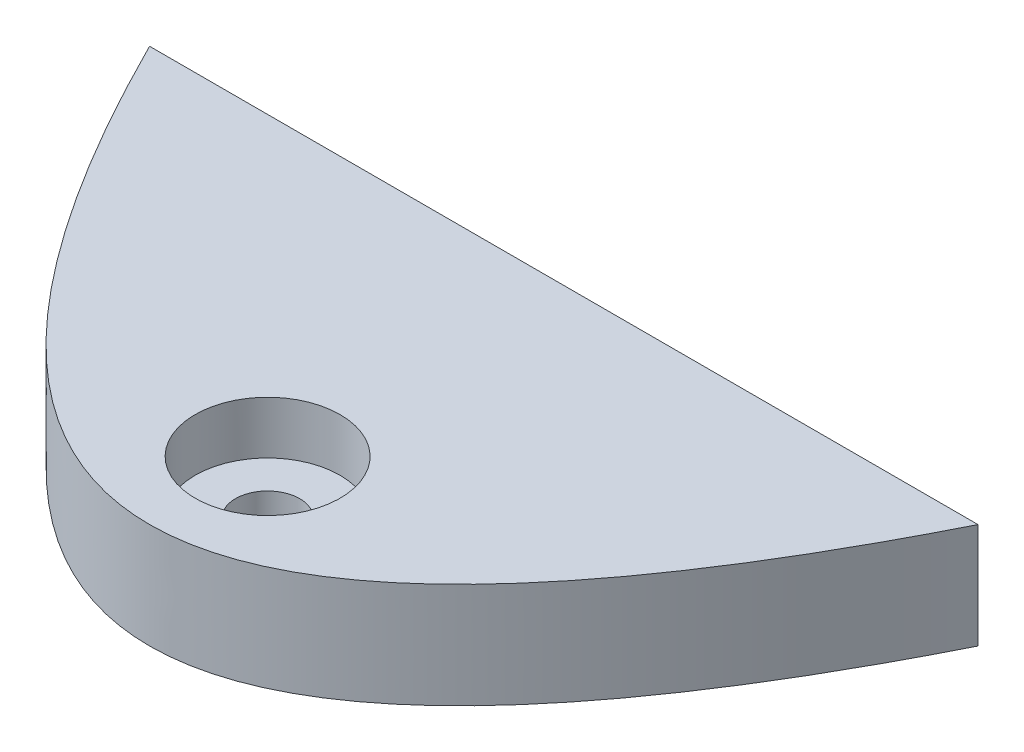
ISO-10303-21;
HEADER;
FILE_DESCRIPTION(('STEP AP214'),'2;1');
FILE_NAME('part.step','',(''),(''),'','','');
FILE_SCHEMA(('AUTOMOTIVE_DESIGN { 1 0 10303 214 1 1 1 1 }'));
ENDSEC;
DATA;
#1=APPLICATION_CONTEXT('core data for automotive mechanical design processes');
#2=APPLICATION_PROTOCOL_DEFINITION('international standard','automotive_design',2000,#1);
#3=PRODUCT_CONTEXT('',#1,'mechanical');
#4=PRODUCT('Part','Part','',(#3));
#5=PRODUCT_RELATED_PRODUCT_CATEGORY('part','',(#4));
#6=PRODUCT_DEFINITION_FORMATION('','',#4);
#7=PRODUCT_DEFINITION_CONTEXT('part definition',#1,'design');
#8=PRODUCT_DEFINITION('design','',#6,#7);
#9=PRODUCT_DEFINITION_SHAPE('','',#8);
#10=(LENGTH_UNIT() NAMED_UNIT(*) SI_UNIT(.MILLI.,.METRE.));
#11=(NAMED_UNIT(*) PLANE_ANGLE_UNIT() SI_UNIT($,.RADIAN.));
#12=(NAMED_UNIT(*) SI_UNIT($,.STERADIAN.) SOLID_ANGLE_UNIT());
#13=UNCERTAINTY_MEASURE_WITH_UNIT(LENGTH_MEASURE(1.E-05),#10,'distance_accuracy_value','');
#14=(GEOMETRIC_REPRESENTATION_CONTEXT(3) GLOBAL_UNCERTAINTY_ASSIGNED_CONTEXT((#13)) GLOBAL_UNIT_ASSIGNED_CONTEXT((#10,
#11,#12)) REPRESENTATION_CONTEXT('',''));
#15=CARTESIAN_POINT('',(0.,0.,0.));
#16=DIRECTION('',(0.,0.,1.));
#17=DIRECTION('',(1.,0.,0.));
#18=AXIS2_PLACEMENT_3D('',#15,#16,#17);
#19=CARTESIAN_POINT('',(0.,173.,142.999999999465));
#20=DIRECTION('',(0.,-1.,0.));
#21=DIRECTION('',(0.,0.,-1.));
#22=AXIS2_PLACEMENT_3D('',#19,#20,#21);
#23=CYLINDRICAL_SURFACE('',#22,15.5);
#24=CARTESIAN_POINT('',(0.,147.6,142.999999999465));
#25=DIRECTION('',(0.,1.,0.));
#26=DIRECTION('',(0.,0.,1.));
#27=AXIS2_PLACEMENT_3D('',#24,#25,#26);
#28=CIRCLE('',#27,15.5);
#29=CARTESIAN_POINT('',(0.,147.6,158.499999999465));
#30=VERTEX_POINT('',#29);
#31=EDGE_CURVE('E85',#30,#30,#28,.T.);
#32=ORIENTED_EDGE('',*,*,#31,.F.);
#33=EDGE_LOOP('',(#32));
#34=FACE_BOUND('',#33,.T.);
#35=CARTESIAN_POINT('',(0.,173.,142.999999999465));
#36=DIRECTION('',(0.,1.,0.));
#37=DIRECTION('',(0.,0.,1.));
#38=AXIS2_PLACEMENT_3D('',#35,#36,#37);
#39=CIRCLE('',#38,15.5);
#40=CARTESIAN_POINT('',(0.,173.,158.499999999465));
#41=VERTEX_POINT('',#40);
#42=EDGE_CURVE('E72',#41,#41,#39,.T.);
#43=ORIENTED_EDGE('',*,*,#42,.T.);
#44=EDGE_LOOP('',(#43));
#45=FACE_BOUND('',#44,.T.);
#46=ADVANCED_FACE('F35',(#34,#45),#23,.F.);
#47=CARTESIAN_POINT('',(0.,473.,142.999999999465));
#48=DIRECTION('',(0.,-1.,0.));
#49=DIRECTION('',(0.,0.,-1.));
#50=AXIS2_PLACEMENT_3D('',#47,#48,#49);
#51=CYLINDRICAL_SURFACE('',#50,35.);
#52=CARTESIAN_POINT('',(0.,198.4,142.999999999465));
#53=DIRECTION('',(0.,-1.,0.));
#54=DIRECTION('',(0.,0.,-1.));
#55=AXIS2_PLACEMENT_3D('',#52,#53,#54);
#56=CIRCLE('',#55,35.);
#57=CARTESIAN_POINT('',(0.,198.4,107.999999999465));
#58=VERTEX_POINT('',#57);
#59=EDGE_CURVE('E62',#58,#58,#56,.T.);
#60=ORIENTED_EDGE('',*,*,#59,.F.);
#61=EDGE_LOOP('',(#60));
#62=FACE_BOUND('',#61,.T.);
#63=CARTESIAN_POINT('',(0.,173.,142.999999999465));
#64=DIRECTION('',(0.,1.,0.));
#65=DIRECTION('',(0.,0.,1.));
#66=AXIS2_PLACEMENT_3D('',#63,#64,#65);
#67=CIRCLE('',#66,35.);
#68=CARTESIAN_POINT('',(0.,173.,177.999999999465));
#69=VERTEX_POINT('',#68);
#70=EDGE_CURVE('E74',#69,#69,#67,.T.);
#71=ORIENTED_EDGE('',*,*,#70,.F.);
#72=EDGE_LOOP('',(#71));
#73=FACE_BOUND('',#72,.T.);
#74=ADVANCED_FACE('F105',(#62,#73),#51,.F.);
#75=CARTESIAN_POINT('',(0.,173.,142.999999999465));
#76=DIRECTION('',(0.,1.,0.));
#77=DIRECTION('',(0.,0.,1.));
#78=AXIS2_PLACEMENT_3D('',#75,#76,#77);
#79=PLANE('',#78);
#80=ORIENTED_EDGE('',*,*,#42,.F.);
#81=EDGE_LOOP('',(#80));
#82=FACE_BOUND('',#81,.T.);
#83=ORIENTED_EDGE('',*,*,#70,.T.);
#84=EDGE_LOOP('',(#83));
#85=FACE_BOUND('',#84,.T.);
#86=ADVANCED_FACE('F108',(#82,#85),#79,.T.);
#87=CARTESIAN_POINT('',(-200.000000000337,300.,-6.70196537155832E-10));
#88=CARTESIAN_POINT('',(-5.91540705308091E-11,300.,400.000000000552));
#89=CARTESIAN_POINT('',(200.000000000219,300.,-4.34305369445553E-10));
#90=B_SPLINE_CURVE_WITH_KNOTS('',2,(#87,#88,#89),.UNSPECIFIED.,.F.,.F.,(3,3),(0.056028396232078,
0.943971603767659),.UNSPECIFIED.);
#91=DIRECTION('',(0.,-1.,0.));
#92=VECTOR('',#91,1.);
#93=SURFACE_OF_LINEAR_EXTRUSION('',#90,#92);
#94=DIRECTION('',(0.,-1.,0.));
#95=VECTOR('',#94,1.);
#96=CARTESIAN_POINT('',(200.000000000156,300.,-5.35238059385865E-10));
#97=LINE('',#96,#95);
#98=CARTESIAN_POINT('',(200.000000000156,198.4,-5.35238059385865E-10));
#99=VERTEX_POINT('',#98);
#100=CARTESIAN_POINT('',(200.000000000156,147.6,0.));
#101=VERTEX_POINT('',#100);
#102=EDGE_CURVE('E11',#99,#101,#97,.T.);
#103=ORIENTED_EDGE('',*,*,#102,.F.);
#104=CARTESIAN_POINT('',(-200.000000000337,198.4,-6.70196537155832E-10));
#105=CARTESIAN_POINT('',(-5.91540705308091E-11,198.4,400.000000000552));
#106=CARTESIAN_POINT('',(200.000000000219,198.4,-4.34305369445553E-10));
#107=B_SPLINE_CURVE_WITH_KNOTS('',2,(#104,#105,#106),.UNSPECIFIED.,.F.,.F.,(3,3),
(0.056028396232078,0.943971603767659),.UNSPECIFIED.);
#108=CARTESIAN_POINT('',(-200.00000000027,198.4,0.));
#109=VERTEX_POINT('',#108);
#110=EDGE_CURVE('E50',#99,#109,#107,.F.);
#111=ORIENTED_EDGE('',*,*,#110,.T.);
#112=DIRECTION('',(0.,-1.,0.));
#113=VECTOR('',#112,1.);
#114=CARTESIAN_POINT('',(-200.00000000027,300.,-5.35238059385865E-10));
#115=LINE('',#114,#113);
#116=CARTESIAN_POINT('',(-200.00000000027,147.6,-5.35238059385865E-10));
#117=VERTEX_POINT('',#116);
#118=EDGE_CURVE('E44',#109,#117,#115,.T.);
#119=ORIENTED_EDGE('',*,*,#118,.T.);
#120=CARTESIAN_POINT('',(-200.000000000337,147.6,-6.70196537155832E-10));
#121=CARTESIAN_POINT('',(-5.91540705308091E-11,147.6,400.000000000552));
#122=CARTESIAN_POINT('',(200.000000000219,147.6,-4.34305369445553E-10));
#123=B_SPLINE_CURVE_WITH_KNOTS('',2,(#120,#121,#122),.UNSPECIFIED.,.F.,.F.,(3,3),
(0.056028396232078,0.943971603767659),.UNSPECIFIED.);
#124=EDGE_CURVE('E88',#117,#101,#123,.T.);
#125=ORIENTED_EDGE('',*,*,#124,.T.);
#126=EDGE_LOOP('',(#103,#111,#119,#125));
#127=FACE_BOUND('',#126,.T.);
#128=ADVANCED_FACE('F37',(#127),#93,.F.);
#129=CARTESIAN_POINT('',(-200.00000000027,300.,-5.35238059385865E-10));
#130=DIRECTION('',(0.,0.,1.));
#131=DIRECTION('',(1.,0.,0.));
#132=AXIS2_PLACEMENT_3D('',#129,#130,#131);
#133=PLANE('',#132);
#134=ORIENTED_EDGE('',*,*,#118,.F.);
#135=DIRECTION('',(-1.,0.,0.));
#136=VECTOR('',#135,1.);
#137=CARTESIAN_POINT('',(262.005201889277,198.4,0.));
#138=LINE('',#137,#136);
#139=EDGE_CURVE('E63',#99,#109,#138,.T.);
#140=ORIENTED_EDGE('',*,*,#139,.F.);
#141=ORIENTED_EDGE('',*,*,#102,.T.);
#142=DIRECTION('',(1.,0.,0.));
#143=VECTOR('',#142,1.);
#144=CARTESIAN_POINT('',(249.331461890909,147.6,0.));
#145=LINE('',#144,#143);
#146=EDGE_CURVE('E71',#117,#101,#145,.T.);
#147=ORIENTED_EDGE('',*,*,#146,.F.);
#148=EDGE_LOOP('',(#134,#140,#141,#147));
#149=FACE_BOUND('',#148,.T.);
#150=ADVANCED_FACE('F69',(#149),#133,.F.);
#151=CARTESIAN_POINT('',(249.331461890909,147.6,200.000000000059));
#152=DIRECTION('',(0.,1.,0.));
#153=DIRECTION('',(0.,0.,1.));
#154=AXIS2_PLACEMENT_3D('',#151,#152,#153);
#155=PLANE('',#154);
#156=ORIENTED_EDGE('',*,*,#31,.T.);
#157=EDGE_LOOP('',(#156));
#158=FACE_BOUND('',#157,.T.);
#159=ORIENTED_EDGE('',*,*,#146,.T.);
#160=ORIENTED_EDGE('',*,*,#124,.F.);
#161=EDGE_LOOP('',(#159,#160));
#162=FACE_BOUND('',#161,.T.);
#163=ADVANCED_FACE('F130',(#158,#162),#155,.F.);
#164=CARTESIAN_POINT('',(262.005201889277,198.4,200.000000000059));
#165=DIRECTION('',(0.,-1.,0.));
#166=DIRECTION('',(0.,0.,-1.));
#167=AXIS2_PLACEMENT_3D('',#164,#165,#166);
#168=PLANE('',#167);
#169=ORIENTED_EDGE('',*,*,#59,.T.);
#170=EDGE_LOOP('',(#169));
#171=FACE_BOUND('',#170,.T.);
#172=ORIENTED_EDGE('',*,*,#139,.T.);
#173=ORIENTED_EDGE('',*,*,#110,.F.);
#174=EDGE_LOOP('',(#172,#173));
#175=FACE_BOUND('',#174,.T.);
#176=ADVANCED_FACE('F65',(#171,#175),#168,.F.);
#177=CLOSED_SHELL('',(#46,#74,#86,#128,#150,#163,#176));
#178=MANIFOLD_SOLID_BREP('B2',#177);
#179=ADVANCED_BREP_SHAPE_REPRESENTATION('',(#18,#178),#14);
#180=SHAPE_DEFINITION_REPRESENTATION(#9,#179);
ENDSEC;
END-ISO-10303-21;
